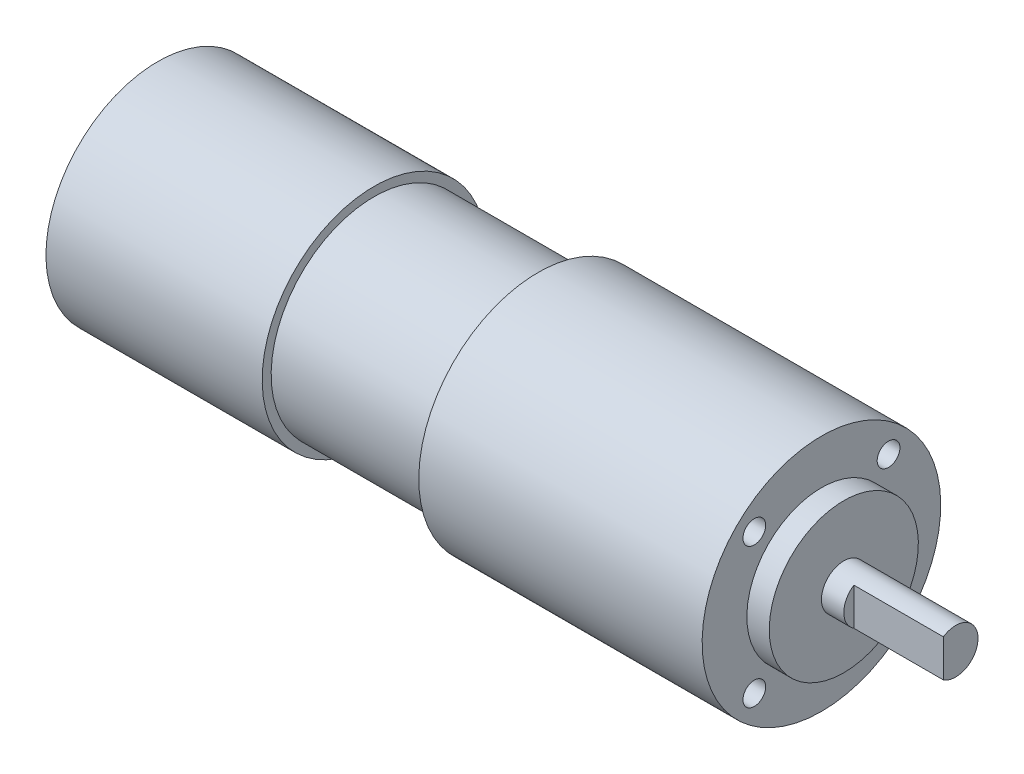
ISO-10303-21;
HEADER;
FILE_DESCRIPTION(('STEP AP214'),'2;1');
FILE_NAME('part.step','',(''),(''),'','','');
FILE_SCHEMA(('AUTOMOTIVE_DESIGN { 1 0 10303 214 1 1 1 1 }'));
ENDSEC;
DATA;
#1=APPLICATION_CONTEXT('core data for automotive mechanical design processes');
#2=APPLICATION_PROTOCOL_DEFINITION('international standard','automotive_design',2000,#1);
#3=PRODUCT_CONTEXT('',#1,'mechanical');
#4=PRODUCT('Part','Part','',(#3));
#5=PRODUCT_RELATED_PRODUCT_CATEGORY('part','',(#4));
#6=PRODUCT_DEFINITION_FORMATION('','',#4);
#7=PRODUCT_DEFINITION_CONTEXT('part definition',#1,'design');
#8=PRODUCT_DEFINITION('design','',#6,#7);
#9=PRODUCT_DEFINITION_SHAPE('','',#8);
#10=(LENGTH_UNIT() NAMED_UNIT(*) SI_UNIT(.MILLI.,.METRE.));
#11=(NAMED_UNIT(*) PLANE_ANGLE_UNIT() SI_UNIT($,.RADIAN.));
#12=(NAMED_UNIT(*) SI_UNIT($,.STERADIAN.) SOLID_ANGLE_UNIT());
#13=UNCERTAINTY_MEASURE_WITH_UNIT(LENGTH_MEASURE(1.E-05),#10,'distance_accuracy_value','');
#14=(GEOMETRIC_REPRESENTATION_CONTEXT(3) GLOBAL_UNCERTAINTY_ASSIGNED_CONTEXT((#13)) GLOBAL_UNIT_ASSIGNED_CONTEXT((#10,
#11,#12)) REPRESENTATION_CONTEXT('',''));
#15=CARTESIAN_POINT('',(0.,0.,0.));
#16=DIRECTION('',(0.,0.,1.));
#17=DIRECTION('',(1.,0.,0.));
#18=AXIS2_PLACEMENT_3D('',#15,#16,#17);
#19=CARTESIAN_POINT('',(0.,0.,0.));
#20=DIRECTION('',(1.,0.,0.));
#21=DIRECTION('',(0.,1.,0.));
#22=AXIS2_PLACEMENT_3D('',#19,#20,#21);
#23=PLANE('',#22);
#24=CARTESIAN_POINT('',(0.,0.,0.));
#25=DIRECTION('',(1.,0.,0.));
#26=DIRECTION('',(0.,1.,0.));
#27=AXIS2_PLACEMENT_3D('',#24,#25,#26);
#28=CIRCLE('',#27,15.);
#29=CARTESIAN_POINT('',(0.,-15.,0.));
#30=VERTEX_POINT('',#29);
#31=EDGE_CURVE('E11',#30,#30,#28,.T.);
#32=ORIENTED_EDGE('',*,*,#31,.F.);
#33=EDGE_LOOP('',(#32));
#34=FACE_BOUND('',#33,.T.);
#35=ADVANCED_FACE('F17',(#34),#23,.F.);
#36=CARTESIAN_POINT('',(29.,0.,0.));
#37=DIRECTION('',(1.,0.,0.));
#38=DIRECTION('',(0.,1.,0.));
#39=AXIS2_PLACEMENT_3D('',#36,#37,#38);
#40=PLANE('',#39);
#41=CARTESIAN_POINT('',(29.,0.,0.));
#42=DIRECTION('',(-1.,0.,0.));
#43=DIRECTION('',(0.,1.,0.));
#44=AXIS2_PLACEMENT_3D('',#41,#42,#43);
#45=CIRCLE('',#44,13.8);
#46=CARTESIAN_POINT('',(29.,-13.8,0.));
#47=VERTEX_POINT('',#46);
#48=EDGE_CURVE('E236',#47,#47,#45,.T.);
#49=ORIENTED_EDGE('',*,*,#48,.T.);
#50=EDGE_LOOP('',(#49));
#51=FACE_BOUND('',#50,.T.);
#52=CARTESIAN_POINT('',(29.,0.,0.));
#53=DIRECTION('',(1.,0.,0.));
#54=DIRECTION('',(0.,1.,0.));
#55=AXIS2_PLACEMENT_3D('',#52,#53,#54);
#56=CIRCLE('',#55,15.);
#57=CARTESIAN_POINT('',(29.,-15.,0.));
#58=VERTEX_POINT('',#57);
#59=EDGE_CURVE('E239',#58,#58,#56,.T.);
#60=ORIENTED_EDGE('',*,*,#59,.T.);
#61=EDGE_LOOP('',(#60));
#62=FACE_BOUND('',#61,.T.);
#63=ADVANCED_FACE('F245',(#51,#62),#40,.T.);
#64=CARTESIAN_POINT('',(0.,0.,0.));
#65=DIRECTION('',(1.,0.,0.));
#66=DIRECTION('',(0.,1.,0.));
#67=AXIS2_PLACEMENT_3D('',#64,#65,#66);
#68=CYLINDRICAL_SURFACE('',#67,15.);
#69=ORIENTED_EDGE('',*,*,#59,.F.);
#70=DIRECTION('',(-1.,0.,0.));
#71=VECTOR('',#70,1.);
#72=CARTESIAN_POINT('',(0.,-15.,0.));
#73=LINE('',#72,#71);
#74=EDGE_CURVE('E25',#58,#30,#73,.T.);
#75=ORIENTED_EDGE('',*,*,#74,.T.);
#76=ORIENTED_EDGE('',*,*,#31,.T.);
#77=ORIENTED_EDGE('',*,*,#74,.F.);
#78=EDGE_LOOP('',(#69,#75,#76,#77));
#79=FACE_BOUND('',#78,.T.);
#80=ADVANCED_FACE('F243',(#79),#68,.T.);
#81=CARTESIAN_POINT('',(29.,0.,0.));
#82=DIRECTION('',(1.,0.,0.));
#83=DIRECTION('',(0.,1.,0.));
#84=AXIS2_PLACEMENT_3D('',#81,#82,#83);
#85=CYLINDRICAL_SURFACE('',#84,13.8);
#86=CARTESIAN_POINT('',(51.,0.,0.));
#87=DIRECTION('',(1.,0.,0.));
#88=DIRECTION('',(0.,1.,0.));
#89=AXIS2_PLACEMENT_3D('',#86,#87,#88);
#90=CIRCLE('',#89,13.8);
#91=CARTESIAN_POINT('',(51.,-13.8,0.));
#92=VERTEX_POINT('',#91);
#93=EDGE_CURVE('E165',#92,#92,#90,.T.);
#94=ORIENTED_EDGE('',*,*,#93,.F.);
#95=DIRECTION('',(-1.,0.,0.));
#96=VECTOR('',#95,1.);
#97=CARTESIAN_POINT('',(29.,-13.8,0.));
#98=LINE('',#97,#96);
#99=EDGE_CURVE('E232',#92,#47,#98,.T.);
#100=ORIENTED_EDGE('',*,*,#99,.T.);
#101=ORIENTED_EDGE('',*,*,#48,.F.);
#102=ORIENTED_EDGE('',*,*,#99,.F.);
#103=EDGE_LOOP('',(#94,#100,#101,#102));
#104=FACE_BOUND('',#103,.T.);
#105=ADVANCED_FACE('F253',(#104),#85,.T.);
#106=CARTESIAN_POINT('',(89.,0.,0.));
#107=DIRECTION('',(1.,0.,0.));
#108=DIRECTION('',(0.,1.,0.));
#109=AXIS2_PLACEMENT_3D('',#106,#107,#108);
#110=PLANE('',#109);
#111=CARTESIAN_POINT('',(89.,0.,0.));
#112=DIRECTION('',(-1.,0.,0.));
#113=DIRECTION('',(0.,1.,0.));
#114=AXIS2_PLACEMENT_3D('',#111,#112,#113);
#115=CIRCLE('',#114,10.);
#116=CARTESIAN_POINT('',(89.,-10.,0.));
#117=VERTEX_POINT('',#116);
#118=EDGE_CURVE('E220',#117,#117,#115,.T.);
#119=ORIENTED_EDGE('',*,*,#118,.T.);
#120=EDGE_LOOP('',(#119));
#121=FACE_BOUND('',#120,.T.);
#122=CARTESIAN_POINT('',(89.,9.38083151964686,-9.));
#123=DIRECTION('',(-1.,0.,0.));
#124=DIRECTION('',(0.,1.,0.));
#125=AXIS2_PLACEMENT_3D('',#122,#123,#124);
#126=CIRCLE('',#125,1.525);
#127=CARTESIAN_POINT('',(89.,7.85583151964686,-9.));
#128=VERTEX_POINT('',#127);
#129=EDGE_CURVE('E172',#128,#128,#126,.T.);
#130=ORIENTED_EDGE('',*,*,#129,.T.);
#131=EDGE_LOOP('',(#130));
#132=FACE_BOUND('',#131,.T.);
#133=CARTESIAN_POINT('',(89.,9.38083151964685,9.));
#134=DIRECTION('',(-1.,0.,0.));
#135=DIRECTION('',(0.,1.,0.));
#136=AXIS2_PLACEMENT_3D('',#133,#134,#135);
#137=CIRCLE('',#136,1.525);
#138=CARTESIAN_POINT('',(89.,7.85583151964685,9.));
#139=VERTEX_POINT('',#138);
#140=EDGE_CURVE('E145',#139,#139,#137,.T.);
#141=ORIENTED_EDGE('',*,*,#140,.T.);
#142=EDGE_LOOP('',(#141));
#143=FACE_BOUND('',#142,.T.);
#144=CARTESIAN_POINT('',(89.,-9.38083151964686,-9.));
#145=DIRECTION('',(-1.,0.,0.));
#146=DIRECTION('',(0.,1.,0.));
#147=AXIS2_PLACEMENT_3D('',#144,#145,#146);
#148=CIRCLE('',#147,1.525);
#149=CARTESIAN_POINT('',(89.,-10.9058315196469,-9.));
#150=VERTEX_POINT('',#149);
#151=EDGE_CURVE('E144',#150,#150,#148,.T.);
#152=ORIENTED_EDGE('',*,*,#151,.T.);
#153=EDGE_LOOP('',(#152));
#154=FACE_BOUND('',#153,.T.);
#155=CARTESIAN_POINT('',(89.,-9.38083151964686,9.));
#156=DIRECTION('',(-1.,0.,0.));
#157=DIRECTION('',(0.,1.,0.));
#158=AXIS2_PLACEMENT_3D('',#155,#156,#157);
#159=CIRCLE('',#158,1.525);
#160=CARTESIAN_POINT('',(89.,-10.9058315196469,9.));
#161=VERTEX_POINT('',#160);
#162=EDGE_CURVE('E127',#161,#161,#159,.T.);
#163=ORIENTED_EDGE('',*,*,#162,.T.);
#164=EDGE_LOOP('',(#163));
#165=FACE_BOUND('',#164,.T.);
#166=CARTESIAN_POINT('',(89.,0.,0.));
#167=DIRECTION('',(1.,0.,0.));
#168=DIRECTION('',(0.,1.,0.));
#169=AXIS2_PLACEMENT_3D('',#166,#167,#168);
#170=CIRCLE('',#169,16.);
#171=CARTESIAN_POINT('',(89.,-16.,0.));
#172=VERTEX_POINT('',#171);
#173=EDGE_CURVE('E160',#172,#172,#170,.T.);
#174=ORIENTED_EDGE('',*,*,#173,.T.);
#175=EDGE_LOOP('',(#174));
#176=FACE_BOUND('',#175,.T.);
#177=ADVANCED_FACE('F133',(#121,#132,#143,#154,#165,#176),#110,.T.);
#178=CARTESIAN_POINT('',(51.,0.,0.));
#179=DIRECTION('',(1.,0.,0.));
#180=DIRECTION('',(0.,1.,0.));
#181=AXIS2_PLACEMENT_3D('',#178,#179,#180);
#182=CYLINDRICAL_SURFACE('',#181,16.);
#183=ORIENTED_EDGE('',*,*,#173,.F.);
#184=DIRECTION('',(-1.,0.,0.));
#185=VECTOR('',#184,1.);
#186=CARTESIAN_POINT('',(51.,-16.,0.));
#187=LINE('',#186,#185);
#188=CARTESIAN_POINT('',(51.,-16.,0.));
#189=VERTEX_POINT('',#188);
#190=EDGE_CURVE('E164',#172,#189,#187,.T.);
#191=ORIENTED_EDGE('',*,*,#190,.T.);
#192=CARTESIAN_POINT('',(51.,0.,0.));
#193=DIRECTION('',(1.,0.,0.));
#194=DIRECTION('',(0.,1.,0.));
#195=AXIS2_PLACEMENT_3D('',#192,#193,#194);
#196=CIRCLE('',#195,16.);
#197=EDGE_CURVE('E223',#189,#189,#196,.T.);
#198=ORIENTED_EDGE('',*,*,#197,.T.);
#199=ORIENTED_EDGE('',*,*,#190,.F.);
#200=EDGE_LOOP('',(#183,#191,#198,#199));
#201=FACE_BOUND('',#200,.T.);
#202=ADVANCED_FACE('F262',(#201),#182,.T.);
#203=CARTESIAN_POINT('',(51.,0.,0.));
#204=DIRECTION('',(1.,0.,0.));
#205=DIRECTION('',(0.,1.,0.));
#206=AXIS2_PLACEMENT_3D('',#203,#204,#205);
#207=PLANE('',#206);
#208=ORIENTED_EDGE('',*,*,#93,.T.);
#209=EDGE_LOOP('',(#208));
#210=FACE_BOUND('',#209,.T.);
#211=ORIENTED_EDGE('',*,*,#197,.F.);
#212=EDGE_LOOP('',(#211));
#213=FACE_BOUND('',#212,.T.);
#214=ADVANCED_FACE('F268',(#210,#213),#207,.F.);
#215=CARTESIAN_POINT('',(92.,0.,0.));
#216=DIRECTION('',(1.,0.,0.));
#217=DIRECTION('',(0.,1.,0.));
#218=AXIS2_PLACEMENT_3D('',#215,#216,#217);
#219=PLANE('',#218);
#220=CARTESIAN_POINT('',(92.,0.,0.));
#221=DIRECTION('',(-1.,0.,0.));
#222=DIRECTION('',(0.,1.,0.));
#223=AXIS2_PLACEMENT_3D('',#220,#221,#222);
#224=CIRCLE('',#223,3.);
#225=CARTESIAN_POINT('',(92.,-3.,0.));
#226=VERTEX_POINT('',#225);
#227=EDGE_CURVE('E206',#226,#226,#224,.T.);
#228=ORIENTED_EDGE('',*,*,#227,.T.);
#229=EDGE_LOOP('',(#228));
#230=FACE_BOUND('',#229,.T.);
#231=CARTESIAN_POINT('',(92.,0.,0.));
#232=DIRECTION('',(1.,0.,0.));
#233=DIRECTION('',(0.,1.,0.));
#234=AXIS2_PLACEMENT_3D('',#231,#232,#233);
#235=CIRCLE('',#234,10.);
#236=CARTESIAN_POINT('',(92.,-10.,0.));
#237=VERTEX_POINT('',#236);
#238=EDGE_CURVE('E212',#237,#237,#235,.T.);
#239=ORIENTED_EDGE('',*,*,#238,.T.);
#240=EDGE_LOOP('',(#239));
#241=FACE_BOUND('',#240,.T.);
#242=ADVANCED_FACE('F264',(#230,#241),#219,.T.);
#243=CARTESIAN_POINT('',(89.,0.,0.));
#244=DIRECTION('',(1.,0.,0.));
#245=DIRECTION('',(0.,1.,0.));
#246=AXIS2_PLACEMENT_3D('',#243,#244,#245);
#247=CYLINDRICAL_SURFACE('',#246,10.);
#248=ORIENTED_EDGE('',*,*,#238,.F.);
#249=DIRECTION('',(-1.,0.,0.));
#250=VECTOR('',#249,1.);
#251=CARTESIAN_POINT('',(89.,-10.,0.));
#252=LINE('',#251,#250);
#253=EDGE_CURVE('E216',#237,#117,#252,.T.);
#254=ORIENTED_EDGE('',*,*,#253,.T.);
#255=ORIENTED_EDGE('',*,*,#118,.F.);
#256=ORIENTED_EDGE('',*,*,#253,.F.);
#257=EDGE_LOOP('',(#248,#254,#255,#256));
#258=FACE_BOUND('',#257,.T.);
#259=ADVANCED_FACE('F267',(#258),#247,.T.);
#260=CARTESIAN_POINT('',(107.,0.,0.));
#261=DIRECTION('',(1.,0.,0.));
#262=DIRECTION('',(0.,1.,0.));
#263=AXIS2_PLACEMENT_3D('',#260,#261,#262);
#264=PLANE('',#263);
#265=DIRECTION('',(0.,-1.,0.));
#266=VECTOR('',#265,1.);
#267=CARTESIAN_POINT('',(107.,1.25274698163676,1.65));
#268=LINE('',#267,#266);
#269=CARTESIAN_POINT('',(107.,2.50549396327351,1.65));
#270=VERTEX_POINT('',#269);
#271=CARTESIAN_POINT('',(107.,-2.50549396327351,1.65));
#272=VERTEX_POINT('',#271);
#273=EDGE_CURVE('E158',#270,#272,#268,.T.);
#274=ORIENTED_EDGE('',*,*,#273,.T.);
#275=CARTESIAN_POINT('',(107.,0.,0.));
#276=DIRECTION('',(1.,0.,0.));
#277=DIRECTION('',(0.,1.,0.));
#278=AXIS2_PLACEMENT_3D('',#275,#276,#277);
#279=CIRCLE('',#278,3.);
#280=CARTESIAN_POINT('',(107.,-3.,0.));
#281=VERTEX_POINT('',#280);
#282=EDGE_CURVE('E209',#272,#281,#279,.T.);
#283=ORIENTED_EDGE('',*,*,#282,.T.);
#284=CARTESIAN_POINT('',(107.,0.,0.));
#285=DIRECTION('',(1.,0.,0.));
#286=DIRECTION('',(0.,1.,0.));
#287=AXIS2_PLACEMENT_3D('',#284,#285,#286);
#288=CIRCLE('',#287,3.);
#289=EDGE_CURVE('E199',#281,#270,#288,.T.);
#290=ORIENTED_EDGE('',*,*,#289,.T.);
#291=EDGE_LOOP('',(#274,#283,#290));
#292=FACE_BOUND('',#291,.T.);
#293=ADVANCED_FACE('F274',(#292),#264,.T.);
#294=CARTESIAN_POINT('',(92.,0.,0.));
#295=DIRECTION('',(1.,0.,0.));
#296=DIRECTION('',(0.,1.,0.));
#297=AXIS2_PLACEMENT_3D('',#294,#295,#296);
#298=CYLINDRICAL_SURFACE('',#297,3.);
#299=DIRECTION('',(-1.,0.,0.));
#300=VECTOR('',#299,1.);
#301=CARTESIAN_POINT('',(92.,-2.50549396327351,1.65));
#302=LINE('',#301,#300);
#303=CARTESIAN_POINT('',(95.,-2.50549396327351,1.65));
#304=VERTEX_POINT('',#303);
#305=EDGE_CURVE('E192',#272,#304,#302,.T.);
#306=ORIENTED_EDGE('',*,*,#305,.T.);
#307=CARTESIAN_POINT('',(95.,0.,0.));
#308=DIRECTION('',(-1.,0.,0.));
#309=DIRECTION('',(0.,1.,0.));
#310=AXIS2_PLACEMENT_3D('',#307,#308,#309);
#311=CIRCLE('',#310,3.);
#312=CARTESIAN_POINT('',(95.,2.50549396327351,1.65));
#313=VERTEX_POINT('',#312);
#314=EDGE_CURVE('E140',#304,#313,#311,.T.);
#315=ORIENTED_EDGE('',*,*,#314,.T.);
#316=DIRECTION('',(1.,0.,0.));
#317=VECTOR('',#316,1.);
#318=CARTESIAN_POINT('',(92.,2.50549396327351,1.65));
#319=LINE('',#318,#317);
#320=EDGE_CURVE('E187',#313,#270,#319,.T.);
#321=ORIENTED_EDGE('',*,*,#320,.T.);
#322=ORIENTED_EDGE('',*,*,#289,.F.);
#323=DIRECTION('',(-1.,0.,0.));
#324=VECTOR('',#323,1.);
#325=CARTESIAN_POINT('',(92.,-3.,0.));
#326=LINE('',#325,#324);
#327=EDGE_CURVE('E202',#281,#226,#326,.T.);
#328=ORIENTED_EDGE('',*,*,#327,.T.);
#329=ORIENTED_EDGE('',*,*,#227,.F.);
#330=ORIENTED_EDGE('',*,*,#327,.F.);
#331=ORIENTED_EDGE('',*,*,#282,.F.);
#332=EDGE_LOOP('',(#306,#315,#321,#322,#328,#329,#330,#331));
#333=FACE_BOUND('',#332,.T.);
#334=ADVANCED_FACE('F270',(#333),#298,.T.);
#335=CARTESIAN_POINT('',(95.,0.,2.325));
#336=DIRECTION('',(1.,0.,0.));
#337=DIRECTION('',(0.,1.,0.));
#338=AXIS2_PLACEMENT_3D('',#335,#336,#337);
#339=PLANE('',#338);
#340=ORIENTED_EDGE('',*,*,#314,.F.);
#341=DIRECTION('',(0.,-1.,0.));
#342=VECTOR('',#341,1.);
#343=CARTESIAN_POINT('',(95.,0.,1.65));
#344=LINE('',#343,#342);
#345=EDGE_CURVE('E191',#313,#304,#344,.T.);
#346=ORIENTED_EDGE('',*,*,#345,.F.);
#347=EDGE_LOOP('',(#340,#346));
#348=FACE_BOUND('',#347,.T.);
#349=ADVANCED_FACE('F273',(#348),#339,.T.);
#350=CARTESIAN_POINT('',(107.,2.50549396327351,1.65));
#351=DIRECTION('',(0.,0.,-1.));
#352=DIRECTION('',(0.,-1.,0.));
#353=AXIS2_PLACEMENT_3D('',#350,#351,#352);
#354=PLANE('',#353);
#355=ORIENTED_EDGE('',*,*,#273,.F.);
#356=ORIENTED_EDGE('',*,*,#320,.F.);
#357=ORIENTED_EDGE('',*,*,#345,.T.);
#358=ORIENTED_EDGE('',*,*,#305,.F.);
#359=EDGE_LOOP('',(#355,#356,#357,#358));
#360=FACE_BOUND('',#359,.T.);
#361=ADVANCED_FACE('F281',(#360),#354,.F.);
#362=CARTESIAN_POINT('',(79.,9.38083151964686,-9.));
#363=DIRECTION('',(1.,0.,0.));
#364=DIRECTION('',(0.,1.,0.));
#365=AXIS2_PLACEMENT_3D('',#362,#363,#364);
#366=PLANE('',#365);
#367=CARTESIAN_POINT('',(79.,9.38083151964686,-9.));
#368=DIRECTION('',(-1.,0.,0.));
#369=DIRECTION('',(0.,1.,0.));
#370=AXIS2_PLACEMENT_3D('',#367,#368,#369);
#371=CIRCLE('',#370,1.525);
#372=CARTESIAN_POINT('',(79.,7.85583151964686,-9.));
#373=VERTEX_POINT('',#372);
#374=EDGE_CURVE('E155',#373,#373,#371,.T.);
#375=ORIENTED_EDGE('',*,*,#374,.F.);
#376=EDGE_LOOP('',(#375));
#377=FACE_BOUND('',#376,.T.);
#378=ADVANCED_FACE('F285',(#377),#366,.T.);
#379=CARTESIAN_POINT('',(89.,9.38083151964686,-9.));
#380=DIRECTION('',(-1.,0.,0.));
#381=DIRECTION('',(0.,1.,0.));
#382=AXIS2_PLACEMENT_3D('',#379,#380,#381);
#383=CYLINDRICAL_SURFACE('',#382,1.525);
#384=ORIENTED_EDGE('',*,*,#129,.F.);
#385=DIRECTION('',(-1.,0.,0.));
#386=VECTOR('',#385,1.);
#387=CARTESIAN_POINT('',(89.,7.85583151964686,-9.));
#388=LINE('',#387,#386);
#389=EDGE_CURVE('E159',#128,#373,#388,.T.);
#390=ORIENTED_EDGE('',*,*,#389,.T.);
#391=ORIENTED_EDGE('',*,*,#374,.T.);
#392=ORIENTED_EDGE('',*,*,#389,.F.);
#393=EDGE_LOOP('',(#384,#390,#391,#392));
#394=FACE_BOUND('',#393,.T.);
#395=ADVANCED_FACE('F291',(#394),#383,.F.);
#396=CARTESIAN_POINT('',(79.,9.38083151964685,9.));
#397=DIRECTION('',(1.,0.,0.));
#398=DIRECTION('',(0.,1.,0.));
#399=AXIS2_PLACEMENT_3D('',#396,#397,#398);
#400=PLANE('',#399);
#401=CARTESIAN_POINT('',(79.,9.38083151964685,9.));
#402=DIRECTION('',(-1.,0.,0.));
#403=DIRECTION('',(0.,1.,0.));
#404=AXIS2_PLACEMENT_3D('',#401,#402,#403);
#405=CIRCLE('',#404,1.525);
#406=CARTESIAN_POINT('',(79.,7.85583151964685,9.));
#407=VERTEX_POINT('',#406);
#408=EDGE_CURVE('E169',#407,#407,#405,.T.);
#409=ORIENTED_EDGE('',*,*,#408,.F.);
#410=EDGE_LOOP('',(#409));
#411=FACE_BOUND('',#410,.T.);
#412=ADVANCED_FACE('F287',(#411),#400,.T.);
#413=CARTESIAN_POINT('',(89.,9.38083151964685,9.));
#414=DIRECTION('',(-1.,0.,0.));
#415=DIRECTION('',(0.,1.,0.));
#416=AXIS2_PLACEMENT_3D('',#413,#414,#415);
#417=CYLINDRICAL_SURFACE('',#416,1.525);
#418=ORIENTED_EDGE('',*,*,#140,.F.);
#419=DIRECTION('',(-1.,0.,0.));
#420=VECTOR('',#419,1.);
#421=CARTESIAN_POINT('',(89.,7.85583151964685,9.));
#422=LINE('',#421,#420);
#423=EDGE_CURVE('E149',#139,#407,#422,.T.);
#424=ORIENTED_EDGE('',*,*,#423,.T.);
#425=ORIENTED_EDGE('',*,*,#408,.T.);
#426=ORIENTED_EDGE('',*,*,#423,.F.);
#427=EDGE_LOOP('',(#418,#424,#425,#426));
#428=FACE_BOUND('',#427,.T.);
#429=ADVANCED_FACE('F290',(#428),#417,.F.);
#430=CARTESIAN_POINT('',(79.,-9.38083151964686,-9.));
#431=DIRECTION('',(1.,0.,0.));
#432=DIRECTION('',(0.,1.,0.));
#433=AXIS2_PLACEMENT_3D('',#430,#431,#432);
#434=PLANE('',#433);
#435=CARTESIAN_POINT('',(79.,-9.38083151964686,-9.));
#436=DIRECTION('',(-1.,0.,0.));
#437=DIRECTION('',(0.,1.,0.));
#438=AXIS2_PLACEMENT_3D('',#435,#436,#437);
#439=CIRCLE('',#438,1.525);
#440=CARTESIAN_POINT('',(79.,-10.9058315196469,-9.));
#441=VERTEX_POINT('',#440);
#442=EDGE_CURVE('E150',#441,#441,#439,.T.);
#443=ORIENTED_EDGE('',*,*,#442,.F.);
#444=EDGE_LOOP('',(#443));
#445=FACE_BOUND('',#444,.T.);
#446=ADVANCED_FACE('F301',(#445),#434,.T.);
#447=CARTESIAN_POINT('',(89.,-9.38083151964686,-9.));
#448=DIRECTION('',(-1.,0.,0.));
#449=DIRECTION('',(0.,1.,0.));
#450=AXIS2_PLACEMENT_3D('',#447,#448,#449);
#451=CYLINDRICAL_SURFACE('',#450,1.525);
#452=ORIENTED_EDGE('',*,*,#151,.F.);
#453=DIRECTION('',(-1.,0.,0.));
#454=VECTOR('',#453,1.);
#455=CARTESIAN_POINT('',(89.,-10.9058315196469,-9.));
#456=LINE('',#455,#454);
#457=EDGE_CURVE('E154',#150,#441,#456,.T.);
#458=ORIENTED_EDGE('',*,*,#457,.T.);
#459=ORIENTED_EDGE('',*,*,#442,.T.);
#460=ORIENTED_EDGE('',*,*,#457,.F.);
#461=EDGE_LOOP('',(#452,#458,#459,#460));
#462=FACE_BOUND('',#461,.T.);
#463=ADVANCED_FACE('F308',(#462),#451,.F.);
#464=CARTESIAN_POINT('',(79.,-9.38083151964686,9.));
#465=DIRECTION('',(1.,0.,0.));
#466=DIRECTION('',(0.,1.,0.));
#467=AXIS2_PLACEMENT_3D('',#464,#465,#466);
#468=PLANE('',#467);
#469=CARTESIAN_POINT('',(79.,-9.38083151964686,9.));
#470=DIRECTION('',(-1.,0.,0.));
#471=DIRECTION('',(0.,1.,0.));
#472=AXIS2_PLACEMENT_3D('',#469,#470,#471);
#473=CIRCLE('',#472,1.525);
#474=CARTESIAN_POINT('',(79.,-10.9058315196469,9.));
#475=VERTEX_POINT('',#474);
#476=EDGE_CURVE('E129',#475,#475,#473,.T.);
#477=ORIENTED_EDGE('',*,*,#476,.F.);
#478=EDGE_LOOP('',(#477));
#479=FACE_BOUND('',#478,.T.);
#480=ADVANCED_FACE('F312',(#479),#468,.T.);
#481=CARTESIAN_POINT('',(89.,-9.38083151964686,9.));
#482=DIRECTION('',(-1.,0.,0.));
#483=DIRECTION('',(0.,1.,0.));
#484=AXIS2_PLACEMENT_3D('',#481,#482,#483);
#485=CYLINDRICAL_SURFACE('',#484,1.525);
#486=ORIENTED_EDGE('',*,*,#162,.F.);
#487=DIRECTION('',(-1.,0.,0.));
#488=VECTOR('',#487,1.);
#489=CARTESIAN_POINT('',(89.,-10.9058315196469,9.));
#490=LINE('',#489,#488);
#491=EDGE_CURVE('E124',#161,#475,#490,.T.);
#492=ORIENTED_EDGE('',*,*,#491,.T.);
#493=ORIENTED_EDGE('',*,*,#476,.T.);
#494=ORIENTED_EDGE('',*,*,#491,.F.);
#495=EDGE_LOOP('',(#486,#492,#493,#494));
#496=FACE_BOUND('',#495,.T.);
#497=ADVANCED_FACE('F126',(#496),#485,.F.);
#498=CLOSED_SHELL('',(#35,#63,#80,#105,#177,#202,#214,#242,#259,#293,#334,#349,#361,#378,#395,
#412,#429,#446,#463,#480,#497));
#499=MANIFOLD_SOLID_BREP('B1',#498);
#500=ADVANCED_BREP_SHAPE_REPRESENTATION('',(#18,#499),#14);
#501=SHAPE_DEFINITION_REPRESENTATION(#9,#500);
ENDSEC;
END-ISO-10303-21;
